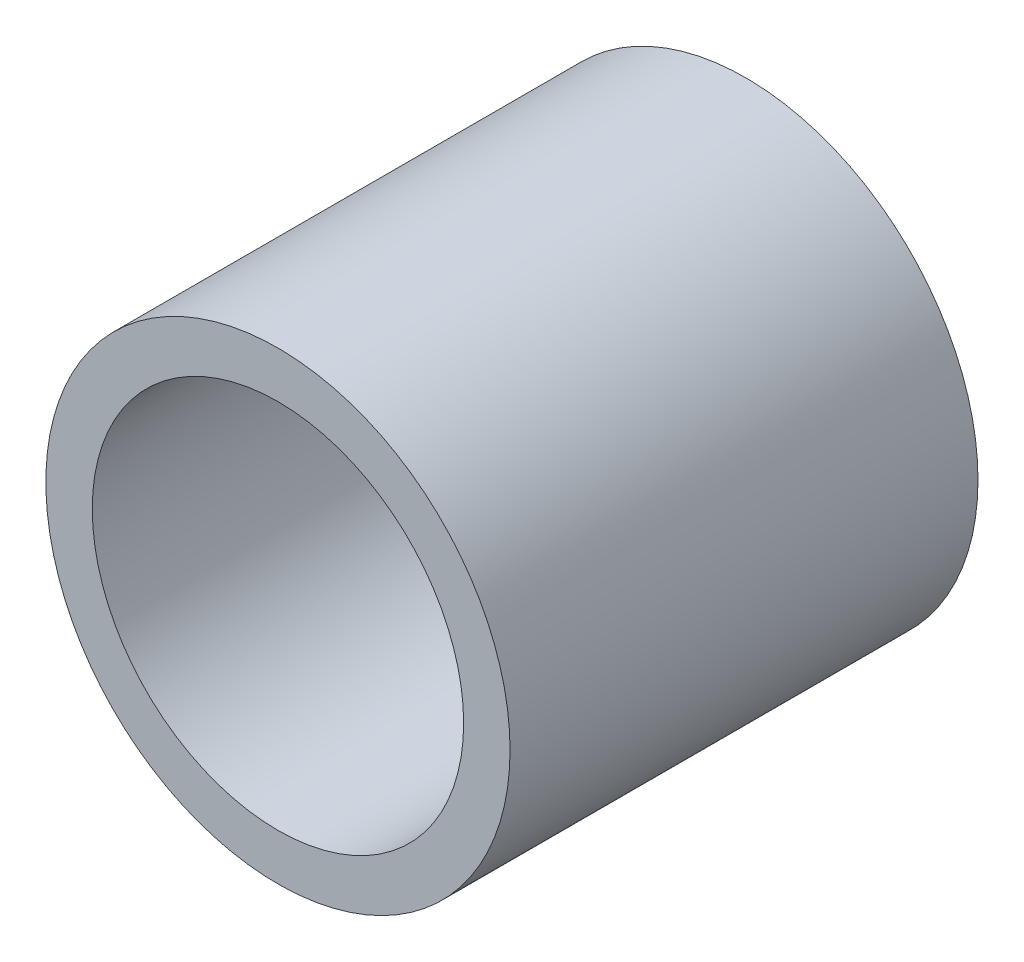
ISO-10303-21;
HEADER;
FILE_DESCRIPTION(('STEP AP214'),'2;1');
FILE_NAME('part.step','',(''),(''),'','','');
FILE_SCHEMA(('AUTOMOTIVE_DESIGN { 1 0 10303 214 1 1 1 1 }'));
ENDSEC;
DATA;
#1=APPLICATION_CONTEXT('core data for automotive mechanical design processes');
#2=APPLICATION_PROTOCOL_DEFINITION('international standard','automotive_design',2000,#1);
#3=PRODUCT_CONTEXT('',#1,'mechanical');
#4=PRODUCT('Part','Part','',(#3));
#5=PRODUCT_RELATED_PRODUCT_CATEGORY('part','',(#4));
#6=PRODUCT_DEFINITION_FORMATION('','',#4);
#7=PRODUCT_DEFINITION_CONTEXT('part definition',#1,'design');
#8=PRODUCT_DEFINITION('design','',#6,#7);
#9=PRODUCT_DEFINITION_SHAPE('','',#8);
#10=(LENGTH_UNIT() NAMED_UNIT(*) SI_UNIT(.MILLI.,.METRE.));
#11=(NAMED_UNIT(*) PLANE_ANGLE_UNIT() SI_UNIT($,.RADIAN.));
#12=(NAMED_UNIT(*) SI_UNIT($,.STERADIAN.) SOLID_ANGLE_UNIT());
#13=UNCERTAINTY_MEASURE_WITH_UNIT(LENGTH_MEASURE(1.E-05),#10,'distance_accuracy_value','');
#14=(GEOMETRIC_REPRESENTATION_CONTEXT(3) GLOBAL_UNCERTAINTY_ASSIGNED_CONTEXT((#13)) GLOBAL_UNIT_ASSIGNED_CONTEXT((#10,
#11,#12)) REPRESENTATION_CONTEXT('',''));
#15=CARTESIAN_POINT('',(0.,0.,0.));
#16=DIRECTION('',(0.,0.,1.));
#17=DIRECTION('',(1.,0.,0.));
#18=AXIS2_PLACEMENT_3D('',#15,#16,#17);
#19=CARTESIAN_POINT('',(0.,0.,8.001));
#20=DIRECTION('',(0.,0.,1.));
#21=DIRECTION('',(1.,0.,0.));
#22=AXIS2_PLACEMENT_3D('',#19,#20,#21);
#23=PLANE('',#22);
#24=CARTESIAN_POINT('',(0.,0.,8.001));
#25=DIRECTION('',(0.,0.,1.));
#26=DIRECTION('',(1.,0.,0.));
#27=AXIS2_PLACEMENT_3D('',#24,#25,#26);
#28=CIRCLE('',#27,7.9375);
#29=CARTESIAN_POINT('',(7.9375,0.,8.001));
#30=VERTEX_POINT('',#29);
#31=EDGE_CURVE('E10',#30,#30,#28,.T.);
#32=ORIENTED_EDGE('',*,*,#31,.T.);
#33=EDGE_LOOP('',(#32));
#34=FACE_BOUND('',#33,.T.);
#35=CARTESIAN_POINT('',(0.,0.,8.001));
#36=DIRECTION('',(0.,0.,1.));
#37=DIRECTION('',(1.,0.,0.));
#38=AXIS2_PLACEMENT_3D('',#35,#36,#37);
#39=CIRCLE('',#38,6.35);
#40=CARTESIAN_POINT('',(6.35,0.,8.001));
#41=VERTEX_POINT('',#40);
#42=EDGE_CURVE('E43',#41,#41,#39,.T.);
#43=ORIENTED_EDGE('',*,*,#42,.F.);
#44=EDGE_LOOP('',(#43));
#45=FACE_BOUND('',#44,.T.);
#46=ADVANCED_FACE('F32',(#34,#45),#23,.T.);
#47=CARTESIAN_POINT('',(0.,0.,-8.001));
#48=DIRECTION('',(0.,0.,1.));
#49=DIRECTION('',(1.,0.,0.));
#50=AXIS2_PLACEMENT_3D('',#47,#48,#49);
#51=PLANE('',#50);
#52=CARTESIAN_POINT('',(0.,0.,-8.001));
#53=DIRECTION('',(0.,0.,1.));
#54=DIRECTION('',(1.,0.,0.));
#55=AXIS2_PLACEMENT_3D('',#52,#53,#54);
#56=CIRCLE('',#55,7.9375);
#57=CARTESIAN_POINT('',(7.9375,0.,-8.001));
#58=VERTEX_POINT('',#57);
#59=EDGE_CURVE('E36',#58,#58,#56,.T.);
#60=ORIENTED_EDGE('',*,*,#59,.F.);
#61=EDGE_LOOP('',(#60));
#62=FACE_BOUND('',#61,.T.);
#63=CARTESIAN_POINT('',(0.,0.,-8.001));
#64=DIRECTION('',(0.,0.,1.));
#65=DIRECTION('',(1.,0.,0.));
#66=AXIS2_PLACEMENT_3D('',#63,#64,#65);
#67=CIRCLE('',#66,6.35);
#68=CARTESIAN_POINT('',(6.35,0.,-8.001));
#69=VERTEX_POINT('',#68);
#70=EDGE_CURVE('E45',#69,#69,#67,.T.);
#71=ORIENTED_EDGE('',*,*,#70,.T.);
#72=EDGE_LOOP('',(#71));
#73=FACE_BOUND('',#72,.T.);
#74=ADVANCED_FACE('F55',(#62,#73),#51,.F.);
#75=CARTESIAN_POINT('',(0.,0.,8.001));
#76=DIRECTION('',(0.,0.,-1.));
#77=DIRECTION('',(-1.,0.,0.));
#78=AXIS2_PLACEMENT_3D('',#75,#76,#77);
#79=CYLINDRICAL_SURFACE('',#78,7.9375);
#80=ORIENTED_EDGE('',*,*,#31,.F.);
#81=EDGE_LOOP('',(#80));
#82=FACE_BOUND('',#81,.T.);
#83=ORIENTED_EDGE('',*,*,#59,.T.);
#84=EDGE_LOOP('',(#83));
#85=FACE_BOUND('',#84,.T.);
#86=ADVANCED_FACE('F34',(#82,#85),#79,.T.);
#87=CARTESIAN_POINT('',(0.,0.,8.001));
#88=DIRECTION('',(0.,0.,-1.));
#89=DIRECTION('',(-1.,0.,0.));
#90=AXIS2_PLACEMENT_3D('',#87,#88,#89);
#91=CYLINDRICAL_SURFACE('',#90,6.35);
#92=ORIENTED_EDGE('',*,*,#42,.T.);
#93=EDGE_LOOP('',(#92));
#94=FACE_BOUND('',#93,.T.);
#95=ORIENTED_EDGE('',*,*,#70,.F.);
#96=EDGE_LOOP('',(#95));
#97=FACE_BOUND('',#96,.T.);
#98=ADVANCED_FACE('F51',(#94,#97),#91,.F.);
#99=CLOSED_SHELL('',(#46,#74,#86,#98));
#100=MANIFOLD_SOLID_BREP('B2',#99);
#101=ADVANCED_BREP_SHAPE_REPRESENTATION('',(#18,#100),#14);
#102=SHAPE_DEFINITION_REPRESENTATION(#9,#101);
ENDSEC;
END-ISO-10303-21;
